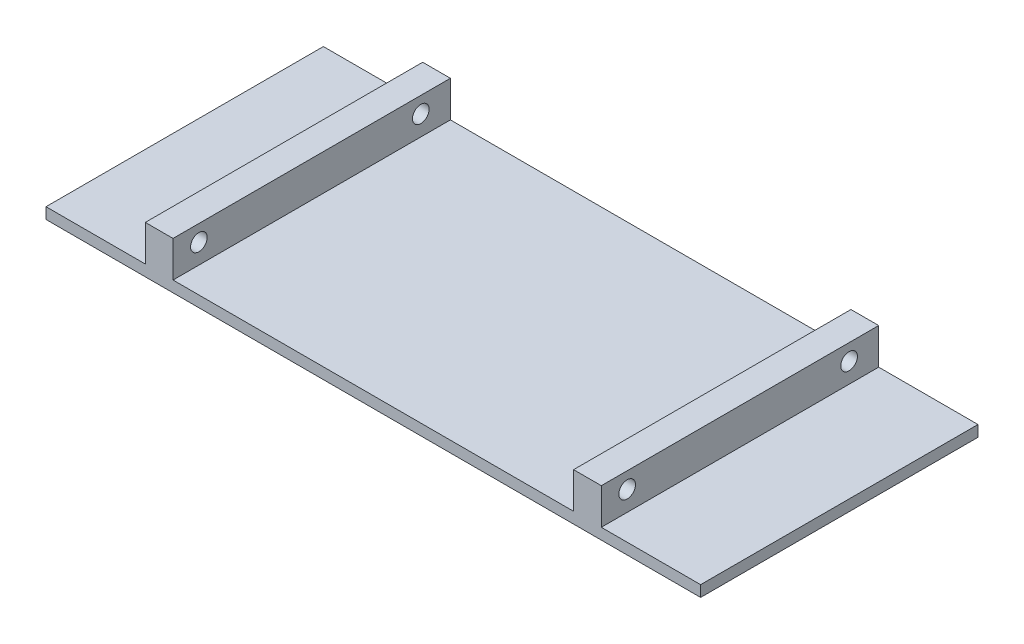
ISO-10303-21;
HEADER;
FILE_DESCRIPTION(('STEP AP214'),'2;1');
FILE_NAME('part.step','',(''),(''),'','','');
FILE_SCHEMA(('AUTOMOTIVE_DESIGN { 1 0 10303 214 1 1 1 1 }'));
ENDSEC;
DATA;
#1=APPLICATION_CONTEXT('core data for automotive mechanical design processes');
#2=APPLICATION_PROTOCOL_DEFINITION('international standard','automotive_design',2000,#1);
#3=PRODUCT_CONTEXT('',#1,'mechanical');
#4=PRODUCT('Part','Part','',(#3));
#5=PRODUCT_RELATED_PRODUCT_CATEGORY('part','',(#4));
#6=PRODUCT_DEFINITION_FORMATION('','',#4);
#7=PRODUCT_DEFINITION_CONTEXT('part definition',#1,'design');
#8=PRODUCT_DEFINITION('design','',#6,#7);
#9=PRODUCT_DEFINITION_SHAPE('','',#8);
#10=(LENGTH_UNIT() NAMED_UNIT(*) SI_UNIT(.MILLI.,.METRE.));
#11=(NAMED_UNIT(*) PLANE_ANGLE_UNIT() SI_UNIT($,.RADIAN.));
#12=(NAMED_UNIT(*) SI_UNIT($,.STERADIAN.) SOLID_ANGLE_UNIT());
#13=UNCERTAINTY_MEASURE_WITH_UNIT(LENGTH_MEASURE(1.E-05),#10,'distance_accuracy_value','');
#14=(GEOMETRIC_REPRESENTATION_CONTEXT(3) GLOBAL_UNCERTAINTY_ASSIGNED_CONTEXT((#13)) GLOBAL_UNIT_ASSIGNED_CONTEXT((#10,
#11,#12)) REPRESENTATION_CONTEXT('',''));
#15=CARTESIAN_POINT('',(0.,0.,0.));
#16=DIRECTION('',(0.,0.,1.));
#17=DIRECTION('',(1.,0.,0.));
#18=AXIS2_PLACEMENT_3D('',#15,#16,#17);
#19=CARTESIAN_POINT('',(0.,2.,0.));
#20=DIRECTION('',(0.,1.,0.));
#21=DIRECTION('',(0.,0.,1.));
#22=AXIS2_PLACEMENT_3D('',#19,#20,#21);
#23=PLANE('',#22);
#24=DIRECTION('',(-1.,0.,0.));
#25=VECTOR('',#24,1.);
#26=CARTESIAN_POINT('',(-59.,2.,-25.));
#27=LINE('',#26,#25);
#28=CARTESIAN_POINT('',(59.,2.,-25.));
#29=VERTEX_POINT('',#28);
#30=CARTESIAN_POINT('',(41.1,2.,-25.));
#31=VERTEX_POINT('',#30);
#32=EDGE_CURVE('E63',#29,#31,#27,.T.);
#33=ORIENTED_EDGE('',*,*,#32,.T.);
#34=DIRECTION('',(0.,0.,-1.));
#35=VECTOR('',#34,1.);
#36=CARTESIAN_POINT('',(41.1,2.,25.));
#37=LINE('',#36,#35);
#38=CARTESIAN_POINT('',(41.1,2.,25.));
#39=VERTEX_POINT('',#38);
#40=EDGE_CURVE('E151',#39,#31,#37,.T.);
#41=ORIENTED_EDGE('',*,*,#40,.F.);
#42=DIRECTION('',(1.,0.,0.));
#43=VECTOR('',#42,1.);
#44=CARTESIAN_POINT('',(-59.,2.,25.));
#45=LINE('',#44,#43);
#46=CARTESIAN_POINT('',(59.,2.,25.));
#47=VERTEX_POINT('',#46);
#48=EDGE_CURVE('E193',#39,#47,#45,.T.);
#49=ORIENTED_EDGE('',*,*,#48,.T.);
#50=DIRECTION('',(0.,0.,-1.));
#51=VECTOR('',#50,1.);
#52=CARTESIAN_POINT('',(59.,2.,-25.));
#53=LINE('',#52,#51);
#54=EDGE_CURVE('E185',#47,#29,#53,.T.);
#55=ORIENTED_EDGE('',*,*,#54,.T.);
#56=EDGE_LOOP('',(#33,#41,#49,#55));
#57=FACE_BOUND('',#56,.T.);
#58=ADVANCED_FACE('F40',(#57),#23,.T.);
#59=CARTESIAN_POINT('',(-36.1,2.,25.));
#60=VERTEX_POINT('',#59);
#61=CARTESIAN_POINT('',(36.1,2.,25.));
#62=VERTEX_POINT('',#61);
#63=EDGE_CURVE('E197',#60,#62,#45,.T.);
#64=ORIENTED_EDGE('',*,*,#63,.T.);
#65=DIRECTION('',(0.,0.,1.));
#66=VECTOR('',#65,1.);
#67=CARTESIAN_POINT('',(36.1,2.,25.));
#68=LINE('',#67,#66);
#69=CARTESIAN_POINT('',(36.1,2.,-25.));
#70=VERTEX_POINT('',#69);
#71=EDGE_CURVE('E55',#70,#62,#68,.T.);
#72=ORIENTED_EDGE('',*,*,#71,.F.);
#73=CARTESIAN_POINT('',(-36.1,2.,-25.));
#74=VERTEX_POINT('',#73);
#75=EDGE_CURVE('E191',#70,#74,#27,.T.);
#76=ORIENTED_EDGE('',*,*,#75,.T.);
#77=DIRECTION('',(0.,0.,-1.));
#78=VECTOR('',#77,1.);
#79=CARTESIAN_POINT('',(-36.1,2.,25.));
#80=LINE('',#79,#78);
#81=EDGE_CURVE('E155',#60,#74,#80,.T.);
#82=ORIENTED_EDGE('',*,*,#81,.F.);
#83=EDGE_LOOP('',(#64,#72,#76,#82));
#84=FACE_BOUND('',#83,.T.);
#85=ADVANCED_FACE('F229',(#84),#23,.T.);
#86=DIRECTION('',(0.,0.,1.));
#87=VECTOR('',#86,1.);
#88=CARTESIAN_POINT('',(-41.1,2.,25.));
#89=LINE('',#88,#87);
#90=CARTESIAN_POINT('',(-41.1,2.,-25.));
#91=VERTEX_POINT('',#90);
#92=CARTESIAN_POINT('',(-41.1,2.,25.));
#93=VERTEX_POINT('',#92);
#94=EDGE_CURVE('E152',#91,#93,#89,.T.);
#95=ORIENTED_EDGE('',*,*,#94,.F.);
#96=CARTESIAN_POINT('',(-59.,2.,-25.));
#97=VERTEX_POINT('',#96);
#98=EDGE_CURVE('E187',#91,#97,#27,.T.);
#99=ORIENTED_EDGE('',*,*,#98,.T.);
#100=DIRECTION('',(0.,0.,1.));
#101=VECTOR('',#100,1.);
#102=CARTESIAN_POINT('',(-59.,2.,-25.));
#103=LINE('',#102,#101);
#104=CARTESIAN_POINT('',(-59.,2.,25.));
#105=VERTEX_POINT('',#104);
#106=EDGE_CURVE('E190',#97,#105,#103,.T.);
#107=ORIENTED_EDGE('',*,*,#106,.T.);
#108=EDGE_CURVE('E194',#105,#93,#45,.T.);
#109=ORIENTED_EDGE('',*,*,#108,.T.);
#110=EDGE_LOOP('',(#95,#99,#107,#109));
#111=FACE_BOUND('',#110,.T.);
#112=ADVANCED_FACE('F295',(#111),#23,.T.);
#113=CARTESIAN_POINT('',(59.,2.,-25.));
#114=DIRECTION('',(-1.,0.,0.));
#115=DIRECTION('',(0.,0.,1.));
#116=AXIS2_PLACEMENT_3D('',#113,#114,#115);
#117=PLANE('',#116);
#118=DIRECTION('',(0.,0.,-1.));
#119=VECTOR('',#118,1.);
#120=CARTESIAN_POINT('',(59.,0.,-25.));
#121=LINE('',#120,#119);
#122=CARTESIAN_POINT('',(59.,0.,25.));
#123=VERTEX_POINT('',#122);
#124=CARTESIAN_POINT('',(59.,0.,-25.));
#125=VERTEX_POINT('',#124);
#126=EDGE_CURVE('E184',#123,#125,#121,.T.);
#127=ORIENTED_EDGE('',*,*,#126,.T.);
#128=DIRECTION('',(0.,-1.,0.));
#129=VECTOR('',#128,1.);
#130=CARTESIAN_POINT('',(59.,2.,-25.));
#131=LINE('',#130,#129);
#132=EDGE_CURVE('E11',#29,#125,#131,.T.);
#133=ORIENTED_EDGE('',*,*,#132,.F.);
#134=ORIENTED_EDGE('',*,*,#54,.F.);
#135=DIRECTION('',(0.,-1.,0.));
#136=VECTOR('',#135,1.);
#137=CARTESIAN_POINT('',(59.,2.,25.));
#138=LINE('',#137,#136);
#139=EDGE_CURVE('E196',#47,#123,#138,.T.);
#140=ORIENTED_EDGE('',*,*,#139,.T.);
#141=EDGE_LOOP('',(#127,#133,#134,#140));
#142=FACE_BOUND('',#141,.T.);
#143=ADVANCED_FACE('F42',(#142),#117,.F.);
#144=CARTESIAN_POINT('',(-59.,2.,-25.));
#145=DIRECTION('',(0.,0.,1.));
#146=DIRECTION('',(1.,0.,0.));
#147=AXIS2_PLACEMENT_3D('',#144,#145,#146);
#148=PLANE('',#147);
#149=DIRECTION('',(-1.,0.,0.));
#150=VECTOR('',#149,1.);
#151=CARTESIAN_POINT('',(-59.,0.,-25.));
#152=LINE('',#151,#150);
#153=CARTESIAN_POINT('',(-59.,0.,-25.));
#154=VERTEX_POINT('',#153);
#155=EDGE_CURVE('E200',#125,#154,#152,.T.);
#156=ORIENTED_EDGE('',*,*,#155,.T.);
#157=DIRECTION('',(0.,-1.,0.));
#158=VECTOR('',#157,1.);
#159=CARTESIAN_POINT('',(-59.,2.,-25.));
#160=LINE('',#159,#158);
#161=EDGE_CURVE('E48',#97,#154,#160,.T.);
#162=ORIENTED_EDGE('',*,*,#161,.F.);
#163=ORIENTED_EDGE('',*,*,#98,.F.);
#164=DIRECTION('',(0.,-1.,0.));
#165=VECTOR('',#164,1.);
#166=CARTESIAN_POINT('',(-41.1,8.5,-25.));
#167=LINE('',#166,#165);
#168=CARTESIAN_POINT('',(-41.1,8.5,-25.));
#169=VERTEX_POINT('',#168);
#170=EDGE_CURVE('E169',#169,#91,#167,.T.);
#171=ORIENTED_EDGE('',*,*,#170,.F.);
#172=DIRECTION('',(-1.,0.,0.));
#173=VECTOR('',#172,1.);
#174=CARTESIAN_POINT('',(-41.1,8.5,-25.));
#175=LINE('',#174,#173);
#176=CARTESIAN_POINT('',(-36.1,8.5,-25.));
#177=VERTEX_POINT('',#176);
#178=EDGE_CURVE('E168',#177,#169,#175,.T.);
#179=ORIENTED_EDGE('',*,*,#178,.F.);
#180=DIRECTION('',(0.,-1.,0.));
#181=VECTOR('',#180,1.);
#182=CARTESIAN_POINT('',(-36.1,8.5,-25.));
#183=LINE('',#182,#181);
#184=EDGE_CURVE('E175',#177,#74,#183,.T.);
#185=ORIENTED_EDGE('',*,*,#184,.T.);
#186=ORIENTED_EDGE('',*,*,#75,.F.);
#187=DIRECTION('',(0.,-1.,0.));
#188=VECTOR('',#187,1.);
#189=CARTESIAN_POINT('',(36.1,8.5,-25.));
#190=LINE('',#189,#188);
#191=CARTESIAN_POINT('',(36.1,8.5,-25.));
#192=VERTEX_POINT('',#191);
#193=EDGE_CURVE('E136',#192,#70,#190,.T.);
#194=ORIENTED_EDGE('',*,*,#193,.F.);
#195=DIRECTION('',(-1.,0.,0.));
#196=VECTOR('',#195,1.);
#197=CARTESIAN_POINT('',(41.1,8.5,-25.));
#198=LINE('',#197,#196);
#199=CARTESIAN_POINT('',(41.1,8.5,-25.));
#200=VERTEX_POINT('',#199);
#201=EDGE_CURVE('E129',#200,#192,#198,.T.);
#202=ORIENTED_EDGE('',*,*,#201,.F.);
#203=DIRECTION('',(0.,-1.,0.));
#204=VECTOR('',#203,1.);
#205=CARTESIAN_POINT('',(41.1,8.5,-25.));
#206=LINE('',#205,#204);
#207=EDGE_CURVE('E133',#200,#31,#206,.T.);
#208=ORIENTED_EDGE('',*,*,#207,.T.);
#209=ORIENTED_EDGE('',*,*,#32,.F.);
#210=ORIENTED_EDGE('',*,*,#132,.T.);
#211=EDGE_LOOP('',(#156,#162,#163,#171,#179,#185,#186,#194,#202,#208,#209,#210));
#212=FACE_BOUND('',#211,.T.);
#213=ADVANCED_FACE('F131',(#212),#148,.F.);
#214=CARTESIAN_POINT('',(-59.,2.,-25.));
#215=DIRECTION('',(1.,0.,0.));
#216=DIRECTION('',(0.,0.,-1.));
#217=AXIS2_PLACEMENT_3D('',#214,#215,#216);
#218=PLANE('',#217);
#219=DIRECTION('',(0.,0.,1.));
#220=VECTOR('',#219,1.);
#221=CARTESIAN_POINT('',(-59.,0.,-25.));
#222=LINE('',#221,#220);
#223=CARTESIAN_POINT('',(-59.,0.,25.));
#224=VERTEX_POINT('',#223);
#225=EDGE_CURVE('E202',#154,#224,#222,.T.);
#226=ORIENTED_EDGE('',*,*,#225,.T.);
#227=DIRECTION('',(0.,-1.,0.));
#228=VECTOR('',#227,1.);
#229=CARTESIAN_POINT('',(-59.,2.,25.));
#230=LINE('',#229,#228);
#231=EDGE_CURVE('E207',#105,#224,#230,.T.);
#232=ORIENTED_EDGE('',*,*,#231,.F.);
#233=ORIENTED_EDGE('',*,*,#106,.F.);
#234=ORIENTED_EDGE('',*,*,#161,.T.);
#235=EDGE_LOOP('',(#226,#232,#233,#234));
#236=FACE_BOUND('',#235,.T.);
#237=ADVANCED_FACE('F214',(#236),#218,.F.);
#238=CARTESIAN_POINT('',(-59.,2.,25.));
#239=DIRECTION('',(0.,0.,-1.));
#240=DIRECTION('',(-1.,0.,0.));
#241=AXIS2_PLACEMENT_3D('',#238,#239,#240);
#242=PLANE('',#241);
#243=DIRECTION('',(1.,0.,0.));
#244=VECTOR('',#243,1.);
#245=CARTESIAN_POINT('',(-59.,0.,25.));
#246=LINE('',#245,#244);
#247=EDGE_CURVE('E188',#224,#123,#246,.T.);
#248=ORIENTED_EDGE('',*,*,#247,.T.);
#249=ORIENTED_EDGE('',*,*,#139,.F.);
#250=ORIENTED_EDGE('',*,*,#48,.F.);
#251=DIRECTION('',(0.,-1.,0.));
#252=VECTOR('',#251,1.);
#253=CARTESIAN_POINT('',(41.1,8.5,25.));
#254=LINE('',#253,#252);
#255=CARTESIAN_POINT('',(41.1,8.5,25.));
#256=VERTEX_POINT('',#255);
#257=EDGE_CURVE('E236',#256,#39,#254,.T.);
#258=ORIENTED_EDGE('',*,*,#257,.F.);
#259=DIRECTION('',(1.,0.,0.));
#260=VECTOR('',#259,1.);
#261=CARTESIAN_POINT('',(41.1,8.5,25.));
#262=LINE('',#261,#260);
#263=CARTESIAN_POINT('',(36.1,8.5,25.));
#264=VERTEX_POINT('',#263);
#265=EDGE_CURVE('E145',#264,#256,#262,.T.);
#266=ORIENTED_EDGE('',*,*,#265,.F.);
#267=DIRECTION('',(0.,-1.,0.));
#268=VECTOR('',#267,1.);
#269=CARTESIAN_POINT('',(36.1,8.5,25.));
#270=LINE('',#269,#268);
#271=EDGE_CURVE('E157',#264,#62,#270,.T.);
#272=ORIENTED_EDGE('',*,*,#271,.T.);
#273=ORIENTED_EDGE('',*,*,#63,.F.);
#274=DIRECTION('',(0.,-1.,0.));
#275=VECTOR('',#274,1.);
#276=CARTESIAN_POINT('',(-36.1,8.5,25.));
#277=LINE('',#276,#275);
#278=CARTESIAN_POINT('',(-36.1,8.5,25.));
#279=VERTEX_POINT('',#278);
#280=EDGE_CURVE('E178',#279,#60,#277,.T.);
#281=ORIENTED_EDGE('',*,*,#280,.F.);
#282=DIRECTION('',(1.,0.,0.));
#283=VECTOR('',#282,1.);
#284=CARTESIAN_POINT('',(-41.1,8.5,25.));
#285=LINE('',#284,#283);
#286=CARTESIAN_POINT('',(-41.1,8.5,25.));
#287=VERTEX_POINT('',#286);
#288=EDGE_CURVE('E164',#287,#279,#285,.T.);
#289=ORIENTED_EDGE('',*,*,#288,.F.);
#290=DIRECTION('',(0.,-1.,0.));
#291=VECTOR('',#290,1.);
#292=CARTESIAN_POINT('',(-41.1,8.5,25.));
#293=LINE('',#292,#291);
#294=EDGE_CURVE('E181',#287,#93,#293,.T.);
#295=ORIENTED_EDGE('',*,*,#294,.T.);
#296=ORIENTED_EDGE('',*,*,#108,.F.);
#297=ORIENTED_EDGE('',*,*,#231,.T.);
#298=EDGE_LOOP('',(#248,#249,#250,#258,#266,#272,#273,#281,#289,#295,#296,#297));
#299=FACE_BOUND('',#298,.T.);
#300=ADVANCED_FACE('F223',(#299),#242,.F.);
#301=CARTESIAN_POINT('',(0.,0.,0.));
#302=DIRECTION('',(0.,1.,0.));
#303=DIRECTION('',(0.,0.,1.));
#304=AXIS2_PLACEMENT_3D('',#301,#302,#303);
#305=PLANE('',#304);
#306=ORIENTED_EDGE('',*,*,#126,.F.);
#307=ORIENTED_EDGE('',*,*,#247,.F.);
#308=ORIENTED_EDGE('',*,*,#225,.F.);
#309=ORIENTED_EDGE('',*,*,#155,.F.);
#310=EDGE_LOOP('',(#306,#307,#308,#309));
#311=FACE_BOUND('',#310,.T.);
#312=ADVANCED_FACE('F220',(#311),#305,.F.);
#313=CARTESIAN_POINT('',(-41.1,8.5,25.));
#314=DIRECTION('',(1.,0.,0.));
#315=DIRECTION('',(0.,0.,-1.));
#316=AXIS2_PLACEMENT_3D('',#313,#314,#315);
#317=PLANE('',#316);
#318=CARTESIAN_POINT('',(-41.1,5.58977613052102,20.34));
#319=DIRECTION('',(1.,0.,0.));
#320=DIRECTION('',(0.,0.,-1.));
#321=AXIS2_PLACEMENT_3D('',#318,#319,#320);
#322=CIRCLE('',#321,1.5);
#323=CARTESIAN_POINT('',(-41.1,5.58977613052102,18.84));
#324=VERTEX_POINT('',#323);
#325=EDGE_CURVE('E240',#324,#324,#322,.T.);
#326=ORIENTED_EDGE('',*,*,#325,.T.);
#327=EDGE_LOOP('',(#326));
#328=FACE_BOUND('',#327,.T.);
#329=CARTESIAN_POINT('',(-41.1,5.60000000000001,-19.66));
#330=DIRECTION('',(1.,0.,0.));
#331=DIRECTION('',(0.,0.,-1.));
#332=AXIS2_PLACEMENT_3D('',#329,#330,#331);
#333=CIRCLE('',#332,1.5);
#334=CARTESIAN_POINT('',(-41.1,5.60000000000001,-21.16));
#335=VERTEX_POINT('',#334);
#336=EDGE_CURVE('E245',#335,#335,#333,.T.);
#337=ORIENTED_EDGE('',*,*,#336,.T.);
#338=EDGE_LOOP('',(#337));
#339=FACE_BOUND('',#338,.T.);
#340=ORIENTED_EDGE('',*,*,#94,.T.);
#341=ORIENTED_EDGE('',*,*,#294,.F.);
#342=DIRECTION('',(0.,0.,1.));
#343=VECTOR('',#342,1.);
#344=CARTESIAN_POINT('',(-41.1,8.5,25.));
#345=LINE('',#344,#343);
#346=EDGE_CURVE('E161',#169,#287,#345,.T.);
#347=ORIENTED_EDGE('',*,*,#346,.F.);
#348=ORIENTED_EDGE('',*,*,#170,.T.);
#349=EDGE_LOOP('',(#340,#341,#347,#348));
#350=FACE_BOUND('',#349,.T.);
#351=ADVANCED_FACE('F313',(#328,#339,#350),#317,.F.);
#352=CARTESIAN_POINT('',(-36.1,8.5,25.));
#353=DIRECTION('',(-1.,0.,0.));
#354=DIRECTION('',(0.,0.,1.));
#355=AXIS2_PLACEMENT_3D('',#352,#353,#354);
#356=PLANE('',#355);
#357=CARTESIAN_POINT('',(-36.1,5.58977613052102,20.34));
#358=DIRECTION('',(1.,0.,0.));
#359=DIRECTION('',(0.,0.,-1.));
#360=AXIS2_PLACEMENT_3D('',#357,#358,#359);
#361=CIRCLE('',#360,1.5);
#362=CARTESIAN_POINT('',(-36.1,5.58977613052102,18.84));
#363=VERTEX_POINT('',#362);
#364=EDGE_CURVE('E248',#363,#363,#361,.T.);
#365=ORIENTED_EDGE('',*,*,#364,.F.);
#366=EDGE_LOOP('',(#365));
#367=FACE_BOUND('',#366,.T.);
#368=CARTESIAN_POINT('',(-36.1,5.60000000000001,-19.66));
#369=DIRECTION('',(1.,0.,0.));
#370=DIRECTION('',(0.,0.,-1.));
#371=AXIS2_PLACEMENT_3D('',#368,#369,#370);
#372=CIRCLE('',#371,1.5);
#373=CARTESIAN_POINT('',(-36.1,5.60000000000001,-21.16));
#374=VERTEX_POINT('',#373);
#375=EDGE_CURVE('E249',#374,#374,#372,.T.);
#376=ORIENTED_EDGE('',*,*,#375,.F.);
#377=EDGE_LOOP('',(#376));
#378=FACE_BOUND('',#377,.T.);
#379=ORIENTED_EDGE('',*,*,#81,.T.);
#380=ORIENTED_EDGE('',*,*,#184,.F.);
#381=DIRECTION('',(0.,0.,-1.));
#382=VECTOR('',#381,1.);
#383=CARTESIAN_POINT('',(-36.1,8.5,25.));
#384=LINE('',#383,#382);
#385=EDGE_CURVE('E166',#279,#177,#384,.T.);
#386=ORIENTED_EDGE('',*,*,#385,.F.);
#387=ORIENTED_EDGE('',*,*,#280,.T.);
#388=EDGE_LOOP('',(#379,#380,#386,#387));
#389=FACE_BOUND('',#388,.T.);
#390=ADVANCED_FACE('F318',(#367,#378,#389),#356,.F.);
#391=CARTESIAN_POINT('',(0.,8.5,0.));
#392=DIRECTION('',(0.,-1.,0.));
#393=DIRECTION('',(0.,0.,-1.));
#394=AXIS2_PLACEMENT_3D('',#391,#392,#393);
#395=PLANE('',#394);
#396=ORIENTED_EDGE('',*,*,#346,.T.);
#397=ORIENTED_EDGE('',*,*,#288,.T.);
#398=ORIENTED_EDGE('',*,*,#385,.T.);
#399=ORIENTED_EDGE('',*,*,#178,.T.);
#400=EDGE_LOOP('',(#396,#397,#398,#399));
#401=FACE_BOUND('',#400,.T.);
#402=ADVANCED_FACE('F278',(#401),#395,.F.);
#403=CARTESIAN_POINT('',(41.1,8.5,25.));
#404=DIRECTION('',(-1.,0.,0.));
#405=DIRECTION('',(0.,0.,1.));
#406=AXIS2_PLACEMENT_3D('',#403,#404,#405);
#407=PLANE('',#406);
#408=CARTESIAN_POINT('',(41.1,5.58977613052102,20.3399999999999));
#409=DIRECTION('',(-1.,0.,0.));
#410=DIRECTION('',(0.,0.,1.));
#411=AXIS2_PLACEMENT_3D('',#408,#409,#410);
#412=CIRCLE('',#411,1.5);
#413=CARTESIAN_POINT('',(41.1,5.58977613052102,21.8399999999999));
#414=VERTEX_POINT('',#413);
#415=EDGE_CURVE('E252',#414,#414,#412,.F.);
#416=ORIENTED_EDGE('',*,*,#415,.F.);
#417=EDGE_LOOP('',(#416));
#418=FACE_BOUND('',#417,.T.);
#419=CARTESIAN_POINT('',(41.1,5.60000000000001,-19.6600000000001));
#420=DIRECTION('',(-1.,0.,0.));
#421=DIRECTION('',(0.,0.,1.));
#422=AXIS2_PLACEMENT_3D('',#419,#420,#421);
#423=CIRCLE('',#422,1.5);
#424=CARTESIAN_POINT('',(41.1,5.60000000000001,-18.1600000000001));
#425=VERTEX_POINT('',#424);
#426=EDGE_CURVE('E257',#425,#425,#423,.F.);
#427=ORIENTED_EDGE('',*,*,#426,.F.);
#428=EDGE_LOOP('',(#427));
#429=FACE_BOUND('',#428,.T.);
#430=ORIENTED_EDGE('',*,*,#40,.T.);
#431=ORIENTED_EDGE('',*,*,#207,.F.);
#432=DIRECTION('',(0.,0.,-1.));
#433=VECTOR('',#432,1.);
#434=CARTESIAN_POINT('',(41.1,8.5,25.));
#435=LINE('',#434,#433);
#436=EDGE_CURVE('E140',#256,#200,#435,.T.);
#437=ORIENTED_EDGE('',*,*,#436,.F.);
#438=ORIENTED_EDGE('',*,*,#257,.T.);
#439=EDGE_LOOP('',(#430,#431,#437,#438));
#440=FACE_BOUND('',#439,.T.);
#441=ADVANCED_FACE('F150',(#418,#429,#440),#407,.F.);
#442=CARTESIAN_POINT('',(36.1,8.5,25.));
#443=DIRECTION('',(1.,0.,0.));
#444=DIRECTION('',(0.,0.,-1.));
#445=AXIS2_PLACEMENT_3D('',#442,#443,#444);
#446=PLANE('',#445);
#447=CARTESIAN_POINT('',(36.1,5.58977613052102,20.34));
#448=DIRECTION('',(1.,0.,0.));
#449=DIRECTION('',(0.,0.,-1.));
#450=AXIS2_PLACEMENT_3D('',#447,#448,#449);
#451=CIRCLE('',#450,1.5);
#452=CARTESIAN_POINT('',(36.1,5.58977613052102,18.8399999999999));
#453=VERTEX_POINT('',#452);
#454=EDGE_CURVE('E260',#453,#453,#451,.T.);
#455=ORIENTED_EDGE('',*,*,#454,.T.);
#456=EDGE_LOOP('',(#455));
#457=FACE_BOUND('',#456,.T.);
#458=CARTESIAN_POINT('',(36.1,5.60000000000001,-19.6600000000001));
#459=DIRECTION('',(1.,0.,0.));
#460=DIRECTION('',(0.,0.,-1.));
#461=AXIS2_PLACEMENT_3D('',#458,#459,#460);
#462=CIRCLE('',#461,1.5);
#463=CARTESIAN_POINT('',(36.1,5.60000000000001,-21.1600000000001));
#464=VERTEX_POINT('',#463);
#465=EDGE_CURVE('E261',#464,#464,#462,.T.);
#466=ORIENTED_EDGE('',*,*,#465,.T.);
#467=EDGE_LOOP('',(#466));
#468=FACE_BOUND('',#467,.T.);
#469=ORIENTED_EDGE('',*,*,#71,.T.);
#470=ORIENTED_EDGE('',*,*,#271,.F.);
#471=DIRECTION('',(0.,0.,1.));
#472=VECTOR('',#471,1.);
#473=CARTESIAN_POINT('',(36.1,8.5,25.));
#474=LINE('',#473,#472);
#475=EDGE_CURVE('E139',#192,#264,#474,.T.);
#476=ORIENTED_EDGE('',*,*,#475,.F.);
#477=ORIENTED_EDGE('',*,*,#193,.T.);
#478=EDGE_LOOP('',(#469,#470,#476,#477));
#479=FACE_BOUND('',#478,.T.);
#480=ADVANCED_FACE('F234',(#457,#468,#479),#446,.F.);
#481=CARTESIAN_POINT('',(0.,8.5,0.));
#482=DIRECTION('',(0.,1.,0.));
#483=DIRECTION('',(0.,0.,1.));
#484=AXIS2_PLACEMENT_3D('',#481,#482,#483);
#485=PLANE('',#484);
#486=ORIENTED_EDGE('',*,*,#436,.T.);
#487=ORIENTED_EDGE('',*,*,#201,.T.);
#488=ORIENTED_EDGE('',*,*,#475,.T.);
#489=ORIENTED_EDGE('',*,*,#265,.T.);
#490=EDGE_LOOP('',(#486,#487,#488,#489));
#491=FACE_BOUND('',#490,.T.);
#492=ADVANCED_FACE('F143',(#491),#485,.T.);
#493=CARTESIAN_POINT('',(-43.1,5.60000000000001,-19.66));
#494=DIRECTION('',(1.,0.,0.));
#495=DIRECTION('',(0.,0.,-1.));
#496=AXIS2_PLACEMENT_3D('',#493,#494,#495);
#497=CYLINDRICAL_SURFACE('',#496,1.5);
#498=ORIENTED_EDGE('',*,*,#375,.T.);
#499=EDGE_LOOP('',(#498));
#500=FACE_BOUND('',#499,.T.);
#501=ORIENTED_EDGE('',*,*,#336,.F.);
#502=EDGE_LOOP('',(#501));
#503=FACE_BOUND('',#502,.T.);
#504=ADVANCED_FACE('F289',(#500,#503),#497,.F.);
#505=CARTESIAN_POINT('',(-43.1,5.58977613052102,20.34));
#506=DIRECTION('',(1.,0.,0.));
#507=DIRECTION('',(0.,0.,-1.));
#508=AXIS2_PLACEMENT_3D('',#505,#506,#507);
#509=CYLINDRICAL_SURFACE('',#508,1.5);
#510=ORIENTED_EDGE('',*,*,#364,.T.);
#511=EDGE_LOOP('',(#510));
#512=FACE_BOUND('',#511,.T.);
#513=ORIENTED_EDGE('',*,*,#325,.F.);
#514=EDGE_LOOP('',(#513));
#515=FACE_BOUND('',#514,.T.);
#516=ADVANCED_FACE('F283',(#512,#515),#509,.F.);
#517=CARTESIAN_POINT('',(43.1,5.60000000000001,-19.6600000000001));
#518=DIRECTION('',(-1.,0.,0.));
#519=DIRECTION('',(0.,0.,1.));
#520=AXIS2_PLACEMENT_3D('',#517,#518,#519);
#521=CYLINDRICAL_SURFACE('',#520,1.5);
#522=ORIENTED_EDGE('',*,*,#465,.F.);
#523=EDGE_LOOP('',(#522));
#524=FACE_BOUND('',#523,.T.);
#525=ORIENTED_EDGE('',*,*,#426,.T.);
#526=EDGE_LOOP('',(#525));
#527=FACE_BOUND('',#526,.T.);
#528=ADVANCED_FACE('F272',(#524,#527),#521,.F.);
#529=CARTESIAN_POINT('',(43.1,5.58977613052102,20.3399999999999));
#530=DIRECTION('',(-1.,0.,0.));
#531=DIRECTION('',(0.,0.,1.));
#532=AXIS2_PLACEMENT_3D('',#529,#530,#531);
#533=CYLINDRICAL_SURFACE('',#532,1.5);
#534=ORIENTED_EDGE('',*,*,#454,.F.);
#535=EDGE_LOOP('',(#534));
#536=FACE_BOUND('',#535,.T.);
#537=ORIENTED_EDGE('',*,*,#415,.T.);
#538=EDGE_LOOP('',(#537));
#539=FACE_BOUND('',#538,.T.);
#540=ADVANCED_FACE('F269',(#536,#539),#533,.F.);
#541=CLOSED_SHELL('',(#58,#85,#112,#143,#213,#237,#300,#312,#351,#390,#402,#441,#480,#492,#504,
#516,#528,#540));
#542=MANIFOLD_SOLID_BREP('B2',#541);
#543=ADVANCED_BREP_SHAPE_REPRESENTATION('',(#18,#542),#14);
#544=SHAPE_DEFINITION_REPRESENTATION(#9,#543);
ENDSEC;
END-ISO-10303-21;
